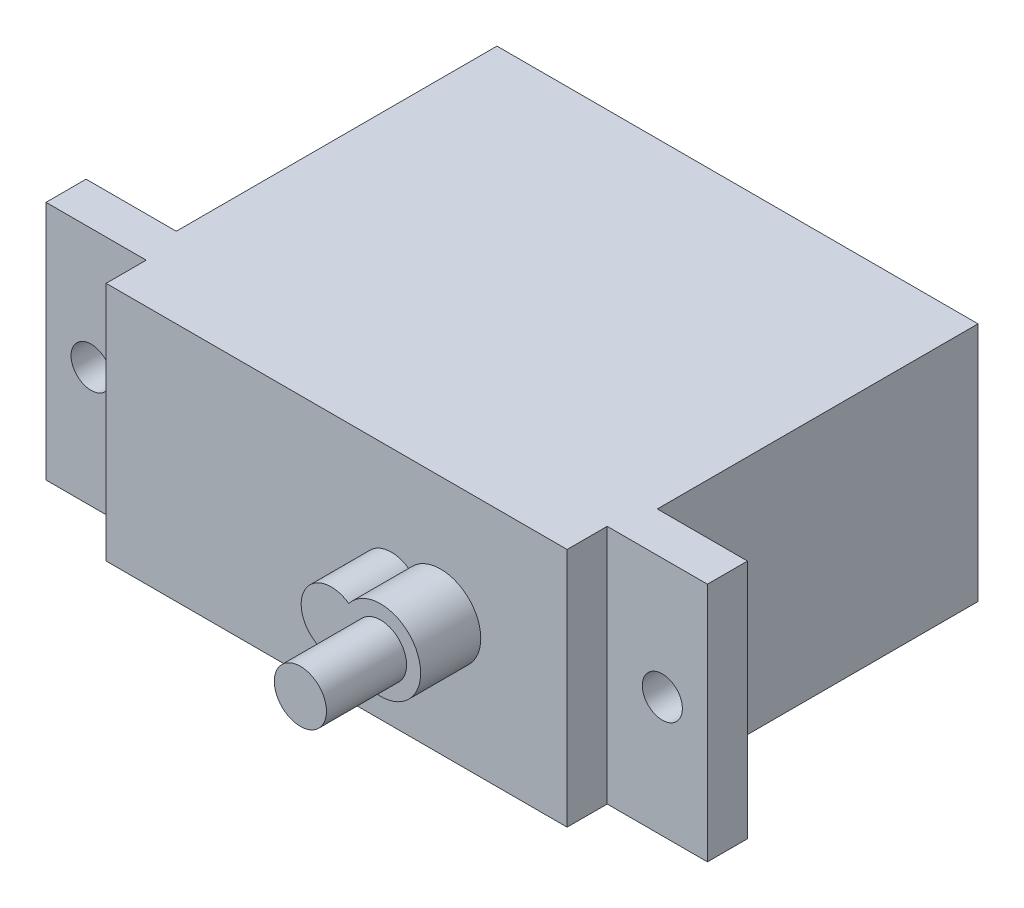
ISO-10303-21;
HEADER;
FILE_DESCRIPTION(('STEP AP214'),'2;1');
FILE_NAME('part.step','',(''),(''),'','','');
FILE_SCHEMA(('AUTOMOTIVE_DESIGN { 1 0 10303 214 1 1 1 1 }'));
ENDSEC;
DATA;
#1=APPLICATION_CONTEXT('core data for automotive mechanical design processes');
#2=APPLICATION_PROTOCOL_DEFINITION('international standard','automotive_design',2000,#1);
#3=PRODUCT_CONTEXT('',#1,'mechanical');
#4=PRODUCT('Part','Part','',(#3));
#5=PRODUCT_RELATED_PRODUCT_CATEGORY('part','',(#4));
#6=PRODUCT_DEFINITION_FORMATION('','',#4);
#7=PRODUCT_DEFINITION_CONTEXT('part definition',#1,'design');
#8=PRODUCT_DEFINITION('design','',#6,#7);
#9=PRODUCT_DEFINITION_SHAPE('','',#8);
#10=(LENGTH_UNIT() NAMED_UNIT(*) SI_UNIT(.MILLI.,.METRE.));
#11=(NAMED_UNIT(*) PLANE_ANGLE_UNIT() SI_UNIT($,.RADIAN.));
#12=(NAMED_UNIT(*) SI_UNIT($,.STERADIAN.) SOLID_ANGLE_UNIT());
#13=UNCERTAINTY_MEASURE_WITH_UNIT(LENGTH_MEASURE(1.E-05),#10,'distance_accuracy_value','');
#14=(GEOMETRIC_REPRESENTATION_CONTEXT(3) GLOBAL_UNCERTAINTY_ASSIGNED_CONTEXT((#13)) GLOBAL_UNIT_ASSIGNED_CONTEXT((#10,
#11,#12)) REPRESENTATION_CONTEXT('',''));
#15=CARTESIAN_POINT('',(0.,0.,0.));
#16=DIRECTION('',(0.,0.,1.));
#17=DIRECTION('',(1.,0.,0.));
#18=AXIS2_PLACEMENT_3D('',#15,#16,#17);
#19=CARTESIAN_POINT('',(0.,0.,10.));
#20=DIRECTION('',(0.,0.,1.));
#21=DIRECTION('',(1.,0.,0.));
#22=AXIS2_PLACEMENT_3D('',#19,#20,#21);
#23=PLANE('',#22);
#24=DIRECTION('',(0.,1.,0.));
#25=VECTOR('',#24,1.);
#26=CARTESIAN_POINT('',(11.5,12.,10.));
#27=LINE('',#26,#25);
#28=CARTESIAN_POINT('',(11.5,0.,10.));
#29=VERTEX_POINT('',#28);
#30=CARTESIAN_POINT('',(11.5,12.,10.));
#31=VERTEX_POINT('',#30);
#32=EDGE_CURVE('E55',#29,#31,#27,.T.);
#33=ORIENTED_EDGE('',*,*,#32,.F.);
#34=DIRECTION('',(1.,0.,0.));
#35=VECTOR('',#34,1.);
#36=CARTESIAN_POINT('',(-16.5,0.,10.));
#37=LINE('',#36,#35);
#38=CARTESIAN_POINT('',(16.5,0.,10.));
#39=VERTEX_POINT('',#38);
#40=EDGE_CURVE('E201',#29,#39,#37,.T.);
#41=ORIENTED_EDGE('',*,*,#40,.T.);
#42=DIRECTION('',(0.,1.,0.));
#43=VECTOR('',#42,1.);
#44=CARTESIAN_POINT('',(16.5,12.,10.));
#45=LINE('',#44,#43);
#46=CARTESIAN_POINT('',(16.5,12.,10.));
#47=VERTEX_POINT('',#46);
#48=EDGE_CURVE('E192',#39,#47,#45,.T.);
#49=ORIENTED_EDGE('',*,*,#48,.T.);
#50=DIRECTION('',(-1.,0.,0.));
#51=VECTOR('',#50,1.);
#52=CARTESIAN_POINT('',(-16.5,12.,10.));
#53=LINE('',#52,#51);
#54=EDGE_CURVE('E197',#47,#31,#53,.T.);
#55=ORIENTED_EDGE('',*,*,#54,.T.);
#56=EDGE_LOOP('',(#33,#41,#49,#55));
#57=FACE_BOUND('',#56,.T.);
#58=CARTESIAN_POINT('',(14.25,5.99999999999999,10.));
#59=DIRECTION('',(0.,0.,-1.));
#60=DIRECTION('',(1.,0.,0.));
#61=AXIS2_PLACEMENT_3D('',#58,#59,#60);
#62=CIRCLE('',#61,1.);
#63=CARTESIAN_POINT('',(15.25,5.99999999999999,10.));
#64=VERTEX_POINT('',#63);
#65=EDGE_CURVE('E187',#64,#64,#62,.T.);
#66=ORIENTED_EDGE('',*,*,#65,.T.);
#67=EDGE_LOOP('',(#66));
#68=FACE_BOUND('',#67,.T.);
#69=ADVANCED_FACE('F33',(#57,#68),#23,.T.);
#70=CARTESIAN_POINT('',(12.,12.,-8.));
#71=DIRECTION('',(-1.,0.,0.));
#72=DIRECTION('',(0.,0.,1.));
#73=AXIS2_PLACEMENT_3D('',#70,#71,#72);
#74=PLANE('',#73);
#75=DIRECTION('',(0.,0.,-1.));
#76=VECTOR('',#75,1.);
#77=CARTESIAN_POINT('',(12.,0.,-8.));
#78=LINE('',#77,#76);
#79=CARTESIAN_POINT('',(12.,0.,8.));
#80=VERTEX_POINT('',#79);
#81=CARTESIAN_POINT('',(12.,0.,-8.));
#82=VERTEX_POINT('',#81);
#83=EDGE_CURVE('E227',#80,#82,#78,.T.);
#84=ORIENTED_EDGE('',*,*,#83,.T.);
#85=DIRECTION('',(0.,-1.,0.));
#86=VECTOR('',#85,1.);
#87=CARTESIAN_POINT('',(12.,12.,-8.));
#88=LINE('',#87,#86);
#89=CARTESIAN_POINT('',(12.,12.,-8.));
#90=VERTEX_POINT('',#89);
#91=EDGE_CURVE('E11',#90,#82,#88,.T.);
#92=ORIENTED_EDGE('',*,*,#91,.F.);
#93=DIRECTION('',(0.,0.,-1.));
#94=VECTOR('',#93,1.);
#95=CARTESIAN_POINT('',(12.,12.,-8.));
#96=LINE('',#95,#94);
#97=CARTESIAN_POINT('',(12.,12.,8.));
#98=VERTEX_POINT('',#97);
#99=EDGE_CURVE('E228',#98,#90,#96,.T.);
#100=ORIENTED_EDGE('',*,*,#99,.F.);
#101=DIRECTION('',(0.,-1.,0.));
#102=VECTOR('',#101,1.);
#103=CARTESIAN_POINT('',(12.,12.,8.));
#104=LINE('',#103,#102);
#105=EDGE_CURVE('E236',#98,#80,#104,.T.);
#106=ORIENTED_EDGE('',*,*,#105,.T.);
#107=EDGE_LOOP('',(#84,#92,#100,#106));
#108=FACE_BOUND('',#107,.T.);
#109=ADVANCED_FACE('F35',(#108),#74,.F.);
#110=CARTESIAN_POINT('',(-12.,12.,-8.));
#111=DIRECTION('',(0.,0.,1.));
#112=DIRECTION('',(1.,0.,0.));
#113=AXIS2_PLACEMENT_3D('',#110,#111,#112);
#114=PLANE('',#113);
#115=DIRECTION('',(-1.,0.,0.));
#116=VECTOR('',#115,1.);
#117=CARTESIAN_POINT('',(-12.,0.,-8.));
#118=LINE('',#117,#116);
#119=CARTESIAN_POINT('',(-12.,0.,-8.));
#120=VERTEX_POINT('',#119);
#121=EDGE_CURVE('E239',#82,#120,#118,.T.);
#122=ORIENTED_EDGE('',*,*,#121,.T.);
#123=DIRECTION('',(0.,-1.,0.));
#124=VECTOR('',#123,1.);
#125=CARTESIAN_POINT('',(-12.,12.,-8.));
#126=LINE('',#125,#124);
#127=CARTESIAN_POINT('',(-12.,12.,-8.));
#128=VERTEX_POINT('',#127);
#129=EDGE_CURVE('E41',#128,#120,#126,.T.);
#130=ORIENTED_EDGE('',*,*,#129,.F.);
#131=DIRECTION('',(-1.,0.,0.));
#132=VECTOR('',#131,1.);
#133=CARTESIAN_POINT('',(-12.,12.,-8.));
#134=LINE('',#133,#132);
#135=EDGE_CURVE('E231',#90,#128,#134,.T.);
#136=ORIENTED_EDGE('',*,*,#135,.F.);
#137=ORIENTED_EDGE('',*,*,#91,.T.);
#138=EDGE_LOOP('',(#122,#130,#136,#137));
#139=FACE_BOUND('',#138,.T.);
#140=ADVANCED_FACE('F299',(#139),#114,.F.);
#141=CARTESIAN_POINT('',(-12.,12.,-8.));
#142=DIRECTION('',(1.,0.,0.));
#143=DIRECTION('',(0.,0.,-1.));
#144=AXIS2_PLACEMENT_3D('',#141,#142,#143);
#145=PLANE('',#144);
#146=DIRECTION('',(0.,0.,1.));
#147=VECTOR('',#146,1.);
#148=CARTESIAN_POINT('',(-12.,0.,-8.));
#149=LINE('',#148,#147);
#150=CARTESIAN_POINT('',(-12.,0.,8.));
#151=VERTEX_POINT('',#150);
#152=EDGE_CURVE('E232',#120,#151,#149,.T.);
#153=ORIENTED_EDGE('',*,*,#152,.T.);
#154=DIRECTION('',(0.,-1.,0.));
#155=VECTOR('',#154,1.);
#156=CARTESIAN_POINT('',(-12.,12.,8.));
#157=LINE('',#156,#155);
#158=CARTESIAN_POINT('',(-12.,12.,8.));
#159=VERTEX_POINT('',#158);
#160=EDGE_CURVE('E243',#159,#151,#157,.T.);
#161=ORIENTED_EDGE('',*,*,#160,.F.);
#162=DIRECTION('',(0.,0.,1.));
#163=VECTOR('',#162,1.);
#164=CARTESIAN_POINT('',(-12.,12.,-8.));
#165=LINE('',#164,#163);
#166=EDGE_CURVE('E234',#128,#159,#165,.T.);
#167=ORIENTED_EDGE('',*,*,#166,.F.);
#168=ORIENTED_EDGE('',*,*,#129,.T.);
#169=EDGE_LOOP('',(#153,#161,#167,#168));
#170=FACE_BOUND('',#169,.T.);
#171=ADVANCED_FACE('F250',(#170),#145,.F.);
#172=CARTESIAN_POINT('',(0.,12.,0.));
#173=DIRECTION('',(0.,1.,0.));
#174=DIRECTION('',(0.,0.,1.));
#175=AXIS2_PLACEMENT_3D('',#172,#173,#174);
#176=PLANE('',#175);
#177=ORIENTED_EDGE('',*,*,#99,.T.);
#178=ORIENTED_EDGE('',*,*,#135,.T.);
#179=ORIENTED_EDGE('',*,*,#166,.T.);
#180=DIRECTION('',(-1.,0.,0.));
#181=VECTOR('',#180,1.);
#182=CARTESIAN_POINT('',(-16.5,12.,8.));
#183=LINE('',#182,#181);
#184=CARTESIAN_POINT('',(-16.5,12.,8.));
#185=VERTEX_POINT('',#184);
#186=EDGE_CURVE('E207',#159,#185,#183,.T.);
#187=ORIENTED_EDGE('',*,*,#186,.T.);
#188=DIRECTION('',(0.,0.,-1.));
#189=VECTOR('',#188,1.);
#190=CARTESIAN_POINT('',(-16.5,12.,10.));
#191=LINE('',#190,#189);
#192=CARTESIAN_POINT('',(-16.5,12.,10.));
#193=VERTEX_POINT('',#192);
#194=EDGE_CURVE('E221',#193,#185,#191,.T.);
#195=ORIENTED_EDGE('',*,*,#194,.F.);
#196=CARTESIAN_POINT('',(-11.5,12.,10.));
#197=VERTEX_POINT('',#196);
#198=EDGE_CURVE('E195',#197,#193,#53,.T.);
#199=ORIENTED_EDGE('',*,*,#198,.F.);
#200=DIRECTION('',(0.,0.,-1.));
#201=VECTOR('',#200,1.);
#202=CARTESIAN_POINT('',(-11.5,12.,12.));
#203=LINE('',#202,#201);
#204=CARTESIAN_POINT('',(-11.5,12.,12.));
#205=VERTEX_POINT('',#204);
#206=EDGE_CURVE('E173',#205,#197,#203,.T.);
#207=ORIENTED_EDGE('',*,*,#206,.F.);
#208=DIRECTION('',(-1.,0.,0.));
#209=VECTOR('',#208,1.);
#210=CARTESIAN_POINT('',(-11.5,12.,12.));
#211=LINE('',#210,#209);
#212=CARTESIAN_POINT('',(11.5,12.,12.));
#213=VERTEX_POINT('',#212);
#214=EDGE_CURVE('E159',#213,#205,#211,.T.);
#215=ORIENTED_EDGE('',*,*,#214,.F.);
#216=DIRECTION('',(0.,0.,-1.));
#217=VECTOR('',#216,1.);
#218=CARTESIAN_POINT('',(11.5,12.,12.));
#219=LINE('',#218,#217);
#220=EDGE_CURVE('E176',#213,#31,#219,.T.);
#221=ORIENTED_EDGE('',*,*,#220,.T.);
#222=ORIENTED_EDGE('',*,*,#54,.F.);
#223=DIRECTION('',(0.,0.,-1.));
#224=VECTOR('',#223,1.);
#225=CARTESIAN_POINT('',(16.5,12.,10.));
#226=LINE('',#225,#224);
#227=CARTESIAN_POINT('',(16.5,12.,8.));
#228=VERTEX_POINT('',#227);
#229=EDGE_CURVE('E224',#47,#228,#226,.T.);
#230=ORIENTED_EDGE('',*,*,#229,.T.);
#231=EDGE_CURVE('E208',#228,#98,#183,.T.);
#232=ORIENTED_EDGE('',*,*,#231,.T.);
#233=EDGE_LOOP('',(#177,#178,#179,#187,#195,#199,#207,#215,#221,#222,#230,#232));
#234=FACE_BOUND('',#233,.T.);
#235=ADVANCED_FACE('F265',(#234),#176,.T.);
#236=CARTESIAN_POINT('',(0.,0.,0.));
#237=DIRECTION('',(0.,1.,0.));
#238=DIRECTION('',(0.,0.,1.));
#239=AXIS2_PLACEMENT_3D('',#236,#237,#238);
#240=PLANE('',#239);
#241=ORIENTED_EDGE('',*,*,#83,.F.);
#242=DIRECTION('',(1.,0.,0.));
#243=VECTOR('',#242,1.);
#244=CARTESIAN_POINT('',(-16.5,0.,8.));
#245=LINE('',#244,#243);
#246=CARTESIAN_POINT('',(16.5,0.,8.));
#247=VERTEX_POINT('',#246);
#248=EDGE_CURVE('E213',#80,#247,#245,.T.);
#249=ORIENTED_EDGE('',*,*,#248,.T.);
#250=DIRECTION('',(0.,0.,-1.));
#251=VECTOR('',#250,1.);
#252=CARTESIAN_POINT('',(16.5,0.,10.));
#253=LINE('',#252,#251);
#254=EDGE_CURVE('E204',#39,#247,#253,.T.);
#255=ORIENTED_EDGE('',*,*,#254,.F.);
#256=ORIENTED_EDGE('',*,*,#40,.F.);
#257=DIRECTION('',(0.,0.,-1.));
#258=VECTOR('',#257,1.);
#259=CARTESIAN_POINT('',(11.5,0.,12.));
#260=LINE('',#259,#258);
#261=CARTESIAN_POINT('',(11.5,0.,12.));
#262=VERTEX_POINT('',#261);
#263=EDGE_CURVE('E164',#262,#29,#260,.T.);
#264=ORIENTED_EDGE('',*,*,#263,.F.);
#265=DIRECTION('',(1.,0.,0.));
#266=VECTOR('',#265,1.);
#267=CARTESIAN_POINT('',(-11.5,0.,12.));
#268=LINE('',#267,#266);
#269=CARTESIAN_POINT('',(-11.5,0.,12.));
#270=VERTEX_POINT('',#269);
#271=EDGE_CURVE('E163',#270,#262,#268,.T.);
#272=ORIENTED_EDGE('',*,*,#271,.F.);
#273=DIRECTION('',(0.,0.,-1.));
#274=VECTOR('',#273,1.);
#275=CARTESIAN_POINT('',(-11.5,0.,12.));
#276=LINE('',#275,#274);
#277=CARTESIAN_POINT('',(-11.5,0.,10.));
#278=VERTEX_POINT('',#277);
#279=EDGE_CURVE('E170',#270,#278,#276,.T.);
#280=ORIENTED_EDGE('',*,*,#279,.T.);
#281=CARTESIAN_POINT('',(-16.5,0.,10.));
#282=VERTEX_POINT('',#281);
#283=EDGE_CURVE('E202',#282,#278,#37,.T.);
#284=ORIENTED_EDGE('',*,*,#283,.F.);
#285=DIRECTION('',(0.,0.,-1.));
#286=VECTOR('',#285,1.);
#287=CARTESIAN_POINT('',(-16.5,0.,10.));
#288=LINE('',#287,#286);
#289=CARTESIAN_POINT('',(-16.5,0.,8.));
#290=VERTEX_POINT('',#289);
#291=EDGE_CURVE('E218',#282,#290,#288,.T.);
#292=ORIENTED_EDGE('',*,*,#291,.T.);
#293=EDGE_CURVE('E196',#290,#151,#245,.T.);
#294=ORIENTED_EDGE('',*,*,#293,.T.);
#295=ORIENTED_EDGE('',*,*,#152,.F.);
#296=ORIENTED_EDGE('',*,*,#121,.F.);
#297=EDGE_LOOP('',(#241,#249,#255,#256,#264,#272,#280,#284,#292,#294,#295,#296));
#298=FACE_BOUND('',#297,.T.);
#299=ADVANCED_FACE('F255',(#298),#240,.F.);
#300=CARTESIAN_POINT('',(0.,0.,8.));
#301=DIRECTION('',(0.,0.,1.));
#302=DIRECTION('',(1.,0.,0.));
#303=AXIS2_PLACEMENT_3D('',#300,#301,#302);
#304=PLANE('',#303);
#305=CARTESIAN_POINT('',(-14.25,6.,8.));
#306=DIRECTION('',(0.,0.,-1.));
#307=DIRECTION('',(-1.,0.,0.));
#308=AXIS2_PLACEMENT_3D('',#305,#306,#307);
#309=CIRCLE('',#308,1.);
#310=CARTESIAN_POINT('',(-15.25,6.,8.));
#311=VERTEX_POINT('',#310);
#312=EDGE_CURVE('E184',#311,#311,#309,.T.);
#313=ORIENTED_EDGE('',*,*,#312,.F.);
#314=EDGE_LOOP('',(#313));
#315=FACE_BOUND('',#314,.T.);
#316=ORIENTED_EDGE('',*,*,#186,.F.);
#317=ORIENTED_EDGE('',*,*,#160,.T.);
#318=ORIENTED_EDGE('',*,*,#293,.F.);
#319=DIRECTION('',(0.,-1.,0.));
#320=VECTOR('',#319,1.);
#321=CARTESIAN_POINT('',(-16.5,12.,8.));
#322=LINE('',#321,#320);
#323=EDGE_CURVE('E211',#185,#290,#322,.T.);
#324=ORIENTED_EDGE('',*,*,#323,.F.);
#325=EDGE_LOOP('',(#316,#317,#318,#324));
#326=FACE_BOUND('',#325,.T.);
#327=ADVANCED_FACE('F262',(#315,#326),#304,.F.);
#328=CARTESIAN_POINT('',(16.5,12.,10.));
#329=DIRECTION('',(-1.,0.,0.));
#330=DIRECTION('',(0.,0.,1.));
#331=AXIS2_PLACEMENT_3D('',#328,#329,#330);
#332=PLANE('',#331);
#333=DIRECTION('',(0.,1.,0.));
#334=VECTOR('',#333,1.);
#335=CARTESIAN_POINT('',(16.5,12.,8.));
#336=LINE('',#335,#334);
#337=EDGE_CURVE('E183',#247,#228,#336,.T.);
#338=ORIENTED_EDGE('',*,*,#337,.T.);
#339=ORIENTED_EDGE('',*,*,#229,.F.);
#340=ORIENTED_EDGE('',*,*,#48,.F.);
#341=ORIENTED_EDGE('',*,*,#254,.T.);
#342=EDGE_LOOP('',(#338,#339,#340,#341));
#343=FACE_BOUND('',#342,.T.);
#344=ADVANCED_FACE('F291',(#343),#332,.F.);
#345=CARTESIAN_POINT('',(-16.5,12.,10.));
#346=DIRECTION('',(1.,0.,0.));
#347=DIRECTION('',(0.,0.,-1.));
#348=AXIS2_PLACEMENT_3D('',#345,#346,#347);
#349=PLANE('',#348);
#350=ORIENTED_EDGE('',*,*,#323,.T.);
#351=ORIENTED_EDGE('',*,*,#291,.F.);
#352=DIRECTION('',(0.,-1.,0.));
#353=VECTOR('',#352,1.);
#354=CARTESIAN_POINT('',(-16.5,12.,10.));
#355=LINE('',#354,#353);
#356=EDGE_CURVE('E199',#193,#282,#355,.T.);
#357=ORIENTED_EDGE('',*,*,#356,.F.);
#358=ORIENTED_EDGE('',*,*,#194,.T.);
#359=EDGE_LOOP('',(#350,#351,#357,#358));
#360=FACE_BOUND('',#359,.T.);
#361=ADVANCED_FACE('F269',(#360),#349,.F.);
#362=DIRECTION('',(0.,-1.,0.));
#363=VECTOR('',#362,1.);
#364=CARTESIAN_POINT('',(-11.5,12.,10.));
#365=LINE('',#364,#363);
#366=EDGE_CURVE('E151',#197,#278,#365,.T.);
#367=ORIENTED_EDGE('',*,*,#366,.F.);
#368=ORIENTED_EDGE('',*,*,#198,.T.);
#369=ORIENTED_EDGE('',*,*,#356,.T.);
#370=ORIENTED_EDGE('',*,*,#283,.T.);
#371=EDGE_LOOP('',(#367,#368,#369,#370));
#372=FACE_BOUND('',#371,.T.);
#373=CARTESIAN_POINT('',(-14.25,6.,10.));
#374=DIRECTION('',(0.,0.,-1.));
#375=DIRECTION('',(-1.,0.,0.));
#376=AXIS2_PLACEMENT_3D('',#373,#374,#375);
#377=CIRCLE('',#376,1.);
#378=CARTESIAN_POINT('',(-15.25,6.,10.));
#379=VERTEX_POINT('',#378);
#380=EDGE_CURVE('E180',#379,#379,#377,.T.);
#381=ORIENTED_EDGE('',*,*,#380,.T.);
#382=EDGE_LOOP('',(#381));
#383=FACE_BOUND('',#382,.T.);
#384=ADVANCED_FACE('F271',(#372,#383),#23,.T.);
#385=CARTESIAN_POINT('',(14.25,5.99999999999999,8.));
#386=DIRECTION('',(0.,0.,-1.));
#387=DIRECTION('',(1.,0.,0.));
#388=AXIS2_PLACEMENT_3D('',#385,#386,#387);
#389=CIRCLE('',#388,1.);
#390=CARTESIAN_POINT('',(15.25,5.99999999999999,8.));
#391=VERTEX_POINT('',#390);
#392=EDGE_CURVE('E179',#391,#391,#389,.T.);
#393=ORIENTED_EDGE('',*,*,#392,.F.);
#394=EDGE_LOOP('',(#393));
#395=FACE_BOUND('',#394,.T.);
#396=ORIENTED_EDGE('',*,*,#105,.F.);
#397=ORIENTED_EDGE('',*,*,#231,.F.);
#398=ORIENTED_EDGE('',*,*,#337,.F.);
#399=ORIENTED_EDGE('',*,*,#248,.F.);
#400=EDGE_LOOP('',(#396,#397,#398,#399));
#401=FACE_BOUND('',#400,.T.);
#402=ADVANCED_FACE('F296',(#395,#401),#304,.F.);
#403=CARTESIAN_POINT('',(14.25,5.99999999999999,10.));
#404=DIRECTION('',(0.,0.,-1.));
#405=DIRECTION('',(-1.,0.,0.));
#406=AXIS2_PLACEMENT_3D('',#403,#404,#405);
#407=CYLINDRICAL_SURFACE('',#406,1.);
#408=ORIENTED_EDGE('',*,*,#65,.F.);
#409=EDGE_LOOP('',(#408));
#410=FACE_BOUND('',#409,.T.);
#411=ORIENTED_EDGE('',*,*,#392,.T.);
#412=EDGE_LOOP('',(#411));
#413=FACE_BOUND('',#412,.T.);
#414=ADVANCED_FACE('F317',(#410,#413),#407,.F.);
#415=CARTESIAN_POINT('',(-14.25,6.,10.));
#416=DIRECTION('',(0.,0.,-1.));
#417=DIRECTION('',(-1.,0.,0.));
#418=AXIS2_PLACEMENT_3D('',#415,#416,#417);
#419=CYLINDRICAL_SURFACE('',#418,1.);
#420=ORIENTED_EDGE('',*,*,#380,.F.);
#421=EDGE_LOOP('',(#420));
#422=FACE_BOUND('',#421,.T.);
#423=ORIENTED_EDGE('',*,*,#312,.T.);
#424=EDGE_LOOP('',(#423));
#425=FACE_BOUND('',#424,.T.);
#426=ADVANCED_FACE('F336',(#422,#425),#419,.F.);
#427=CARTESIAN_POINT('',(11.5,12.,12.));
#428=DIRECTION('',(-1.,0.,0.));
#429=DIRECTION('',(0.,-1.,0.));
#430=AXIS2_PLACEMENT_3D('',#427,#428,#429);
#431=PLANE('',#430);
#432=ORIENTED_EDGE('',*,*,#32,.T.);
#433=ORIENTED_EDGE('',*,*,#220,.F.);
#434=DIRECTION('',(0.,1.,0.));
#435=VECTOR('',#434,1.);
#436=CARTESIAN_POINT('',(11.5,12.,12.));
#437=LINE('',#436,#435);
#438=EDGE_CURVE('E156',#262,#213,#437,.T.);
#439=ORIENTED_EDGE('',*,*,#438,.F.);
#440=ORIENTED_EDGE('',*,*,#263,.T.);
#441=EDGE_LOOP('',(#432,#433,#439,#440));
#442=FACE_BOUND('',#441,.T.);
#443=ADVANCED_FACE('F285',(#442),#431,.F.);
#444=CARTESIAN_POINT('',(-11.5,12.,12.));
#445=DIRECTION('',(1.,0.,0.));
#446=DIRECTION('',(0.,1.,0.));
#447=AXIS2_PLACEMENT_3D('',#444,#445,#446);
#448=PLANE('',#447);
#449=ORIENTED_EDGE('',*,*,#366,.T.);
#450=ORIENTED_EDGE('',*,*,#279,.F.);
#451=DIRECTION('',(0.,-1.,0.));
#452=VECTOR('',#451,1.);
#453=CARTESIAN_POINT('',(-11.5,12.,12.));
#454=LINE('',#453,#452);
#455=EDGE_CURVE('E161',#205,#270,#454,.T.);
#456=ORIENTED_EDGE('',*,*,#455,.F.);
#457=ORIENTED_EDGE('',*,*,#206,.T.);
#458=EDGE_LOOP('',(#449,#450,#456,#457));
#459=FACE_BOUND('',#458,.T.);
#460=ADVANCED_FACE('F276',(#459),#448,.F.);
#461=CARTESIAN_POINT('',(0.,0.,12.));
#462=DIRECTION('',(0.,0.,1.));
#463=DIRECTION('',(1.,0.,0.));
#464=AXIS2_PLACEMENT_3D('',#461,#462,#463);
#465=PLANE('',#464);
#466=CARTESIAN_POINT('',(2.73076121626692,5.99999999999999,12.));
#467=DIRECTION('',(0.,0.,1.));
#468=DIRECTION('',(1.,0.,0.));
#469=AXIS2_PLACEMENT_3D('',#466,#467,#468);
#470=CIRCLE('',#469,1.5);
#471=CARTESIAN_POINT('',(3.60575104160284,7.21835660032628,12.));
#472=VERTEX_POINT('',#471);
#473=CARTESIAN_POINT('',(3.60575104160283,4.78164339967371,12.));
#474=VERTEX_POINT('',#473);
#475=EDGE_CURVE('E149',#472,#474,#470,.T.);
#476=ORIENTED_EDGE('',*,*,#475,.F.);
#477=CARTESIAN_POINT('',(5.19181762105068,5.99999999999999,12.));
#478=DIRECTION('',(0.,0.,1.));
#479=DIRECTION('',(1.,0.,0.));
#480=AXIS2_PLACEMENT_3D('',#477,#478,#479);
#481=CIRCLE('',#480,2.);
#482=EDGE_CURVE('E47',#474,#472,#481,.T.);
#483=ORIENTED_EDGE('',*,*,#482,.F.);
#484=EDGE_LOOP('',(#476,#483));
#485=FACE_BOUND('',#484,.T.);
#486=ORIENTED_EDGE('',*,*,#438,.T.);
#487=ORIENTED_EDGE('',*,*,#214,.T.);
#488=ORIENTED_EDGE('',*,*,#455,.T.);
#489=ORIENTED_EDGE('',*,*,#271,.T.);
#490=EDGE_LOOP('',(#486,#487,#488,#489));
#491=FACE_BOUND('',#490,.T.);
#492=ADVANCED_FACE('F280',(#485,#491),#465,.T.);
#493=CARTESIAN_POINT('',(2.73076121626692,5.99999999999999,15.));
#494=DIRECTION('',(0.,0.,-1.));
#495=DIRECTION('',(-1.,0.,0.));
#496=AXIS2_PLACEMENT_3D('',#493,#494,#495);
#497=CYLINDRICAL_SURFACE('',#496,1.5);
#498=ORIENTED_EDGE('',*,*,#475,.T.);
#499=DIRECTION('',(0.,0.,-1.));
#500=VECTOR('',#499,1.);
#501=CARTESIAN_POINT('',(3.60575104160283,4.78164339967371,15.));
#502=LINE('',#501,#500);
#503=CARTESIAN_POINT('',(3.60575104160283,4.78164339967371,15.));
#504=VERTEX_POINT('',#503);
#505=EDGE_CURVE('E137',#504,#474,#502,.T.);
#506=ORIENTED_EDGE('',*,*,#505,.F.);
#507=CARTESIAN_POINT('',(2.73076121626692,5.99999999999999,15.));
#508=DIRECTION('',(0.,0.,1.));
#509=DIRECTION('',(1.,0.,0.));
#510=AXIS2_PLACEMENT_3D('',#507,#508,#509);
#511=CIRCLE('',#510,1.5);
#512=CARTESIAN_POINT('',(3.60575104160284,7.21835660032628,15.));
#513=VERTEX_POINT('',#512);
#514=EDGE_CURVE('E143',#513,#504,#511,.T.);
#515=ORIENTED_EDGE('',*,*,#514,.F.);
#516=DIRECTION('',(0.,0.,-1.));
#517=VECTOR('',#516,1.);
#518=CARTESIAN_POINT('',(3.60575104160284,7.21835660032628,15.));
#519=LINE('',#518,#517);
#520=EDGE_CURVE('E140',#513,#472,#519,.T.);
#521=ORIENTED_EDGE('',*,*,#520,.T.);
#522=EDGE_LOOP('',(#498,#506,#515,#521));
#523=FACE_BOUND('',#522,.T.);
#524=ADVANCED_FACE('F148',(#523),#497,.T.);
#525=CARTESIAN_POINT('',(5.19181762105068,5.99999999999999,15.));
#526=DIRECTION('',(0.,0.,-1.));
#527=DIRECTION('',(-1.,0.,0.));
#528=AXIS2_PLACEMENT_3D('',#525,#526,#527);
#529=CYLINDRICAL_SURFACE('',#528,2.);
#530=ORIENTED_EDGE('',*,*,#482,.T.);
#531=ORIENTED_EDGE('',*,*,#520,.F.);
#532=CARTESIAN_POINT('',(5.19181762105068,5.99999999999999,15.));
#533=DIRECTION('',(0.,0.,1.));
#534=DIRECTION('',(1.,0.,0.));
#535=AXIS2_PLACEMENT_3D('',#532,#533,#534);
#536=CIRCLE('',#535,2.);
#537=EDGE_CURVE('E133',#504,#513,#536,.T.);
#538=ORIENTED_EDGE('',*,*,#537,.F.);
#539=ORIENTED_EDGE('',*,*,#505,.T.);
#540=EDGE_LOOP('',(#530,#531,#538,#539));
#541=FACE_BOUND('',#540,.T.);
#542=ADVANCED_FACE('F135',(#541),#529,.T.);
#543=CARTESIAN_POINT('',(3.9612894186588,5.99999999999999,15.));
#544=DIRECTION('',(0.,0.,1.));
#545=DIRECTION('',(1.,0.,0.));
#546=AXIS2_PLACEMENT_3D('',#543,#544,#545);
#547=PLANE('',#546);
#548=CARTESIAN_POINT('',(5.19181762105068,5.99999999999999,15.));
#549=DIRECTION('',(0.,0.,1.));
#550=DIRECTION('',(1.,0.,0.));
#551=AXIS2_PLACEMENT_3D('',#548,#549,#550);
#552=CIRCLE('',#551,1.3);
#553=CARTESIAN_POINT('',(6.49181762105068,5.99999999999999,15.));
#554=VERTEX_POINT('',#553);
#555=EDGE_CURVE('E371',#554,#554,#552,.T.);
#556=ORIENTED_EDGE('',*,*,#555,.F.);
#557=EDGE_LOOP('',(#556));
#558=FACE_BOUND('',#557,.T.);
#559=ORIENTED_EDGE('',*,*,#514,.T.);
#560=ORIENTED_EDGE('',*,*,#537,.T.);
#561=EDGE_LOOP('',(#559,#560));
#562=FACE_BOUND('',#561,.T.);
#563=ADVANCED_FACE('F145',(#558,#562),#547,.T.);
#564=CARTESIAN_POINT('',(5.19181762105068,5.99999999999999,19.));
#565=DIRECTION('',(0.,0.,-1.));
#566=DIRECTION('',(-1.,0.,0.));
#567=AXIS2_PLACEMENT_3D('',#564,#565,#566);
#568=CYLINDRICAL_SURFACE('',#567,1.3);
#569=CARTESIAN_POINT('',(5.19181762105068,5.99999999999999,19.));
#570=DIRECTION('',(0.,0.,1.));
#571=DIRECTION('',(1.,0.,0.));
#572=AXIS2_PLACEMENT_3D('',#569,#570,#571);
#573=CIRCLE('',#572,1.3);
#574=CARTESIAN_POINT('',(6.49181762105068,5.99999999999999,19.));
#575=VERTEX_POINT('',#574);
#576=EDGE_CURVE('E370',#575,#575,#573,.T.);
#577=ORIENTED_EDGE('',*,*,#576,.F.);
#578=EDGE_LOOP('',(#577));
#579=FACE_BOUND('',#578,.T.);
#580=ORIENTED_EDGE('',*,*,#555,.T.);
#581=EDGE_LOOP('',(#580));
#582=FACE_BOUND('',#581,.T.);
#583=ADVANCED_FACE('F358',(#579,#582),#568,.T.);
#584=CARTESIAN_POINT('',(5.19181762105068,5.99999999999999,19.));
#585=DIRECTION('',(0.,0.,1.));
#586=DIRECTION('',(1.,0.,0.));
#587=AXIS2_PLACEMENT_3D('',#584,#585,#586);
#588=PLANE('',#587);
#589=ORIENTED_EDGE('',*,*,#576,.T.);
#590=EDGE_LOOP('',(#589));
#591=FACE_BOUND('',#590,.T.);
#592=ADVANCED_FACE('F362',(#591),#588,.T.);
#593=CLOSED_SHELL('',(#69,#109,#140,#171,#235,#299,#327,#344,#361,#384,#402,#414,#426,#443,#460,
#492,#524,#542,#563,#583,#592));
#594=MANIFOLD_SOLID_BREP('B2',#593);
#595=ADVANCED_BREP_SHAPE_REPRESENTATION('',(#18,#594),#14);
#596=SHAPE_DEFINITION_REPRESENTATION(#9,#595);
ENDSEC;
END-ISO-10303-21;
